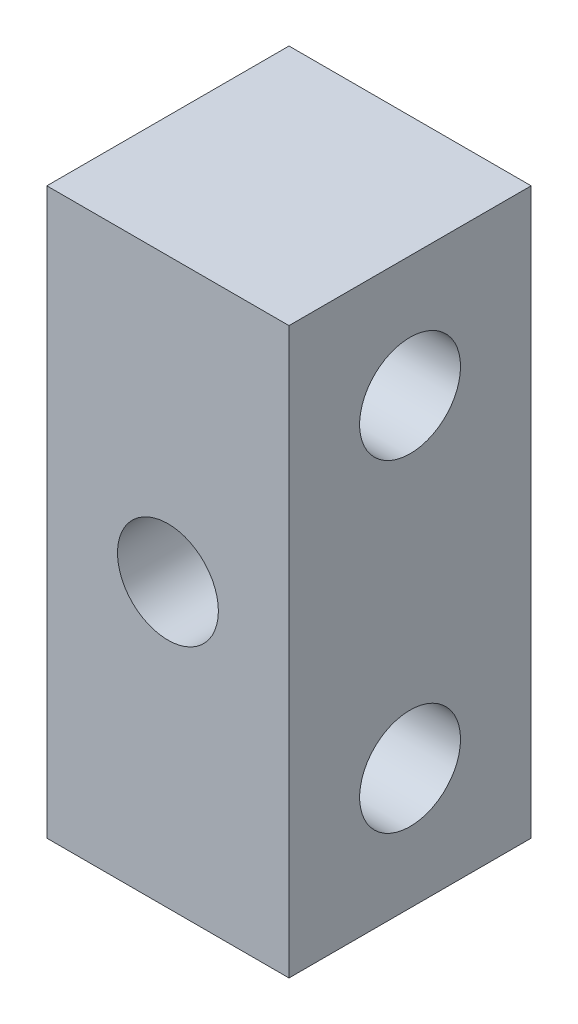
ISO-10303-21;
HEADER;
FILE_DESCRIPTION(('STEP AP214'),'2;1');
FILE_NAME('part.step','',(''),(''),'','','');
FILE_SCHEMA(('AUTOMOTIVE_DESIGN { 1 0 10303 214 1 1 1 1 }'));
ENDSEC;
DATA;
#1=APPLICATION_CONTEXT('core data for automotive mechanical design processes');
#2=APPLICATION_PROTOCOL_DEFINITION('international standard','automotive_design',2000,#1);
#3=PRODUCT_CONTEXT('',#1,'mechanical');
#4=PRODUCT('Part','Part','',(#3));
#5=PRODUCT_RELATED_PRODUCT_CATEGORY('part','',(#4));
#6=PRODUCT_DEFINITION_FORMATION('','',#4);
#7=PRODUCT_DEFINITION_CONTEXT('part definition',#1,'design');
#8=PRODUCT_DEFINITION('design','',#6,#7);
#9=PRODUCT_DEFINITION_SHAPE('','',#8);
#10=(LENGTH_UNIT() NAMED_UNIT(*) SI_UNIT(.MILLI.,.METRE.));
#11=(NAMED_UNIT(*) PLANE_ANGLE_UNIT() SI_UNIT($,.RADIAN.));
#12=(NAMED_UNIT(*) SI_UNIT($,.STERADIAN.) SOLID_ANGLE_UNIT());
#13=UNCERTAINTY_MEASURE_WITH_UNIT(LENGTH_MEASURE(1.E-05),#10,'distance_accuracy_value','');
#14=(GEOMETRIC_REPRESENTATION_CONTEXT(3) GLOBAL_UNCERTAINTY_ASSIGNED_CONTEXT((#13)) GLOBAL_UNIT_ASSIGNED_CONTEXT((#10,
#11,#12)) REPRESENTATION_CONTEXT('',''));
#15=CARTESIAN_POINT('',(0.,0.,0.));
#16=DIRECTION('',(0.,0.,1.));
#17=DIRECTION('',(1.,0.,0.));
#18=AXIS2_PLACEMENT_3D('',#15,#16,#17);
#19=CARTESIAN_POINT('',(6.,0.,0.));
#20=DIRECTION('',(1.,0.,0.));
#21=DIRECTION('',(0.,0.,-1.));
#22=AXIS2_PLACEMENT_3D('',#19,#20,#21);
#23=PLANE('',#22);
#24=CARTESIAN_POINT('',(6.,4.,0.));
#25=DIRECTION('',(1.,0.,0.));
#26=DIRECTION('',(0.,0.,-1.));
#27=AXIS2_PLACEMENT_3D('',#24,#25,#26);
#28=CIRCLE('',#27,1.25);
#29=CARTESIAN_POINT('',(6.,4.,-1.25));
#30=VERTEX_POINT('',#29);
#31=EDGE_CURVE('E103',#30,#30,#28,.T.);
#32=ORIENTED_EDGE('',*,*,#31,.F.);
#33=EDGE_LOOP('',(#32));
#34=FACE_BOUND('',#33,.T.);
#35=DIRECTION('',(0.,1.,0.));
#36=VECTOR('',#35,1.);
#37=CARTESIAN_POINT('',(6.,7.,-3.));
#38=LINE('',#37,#36);
#39=CARTESIAN_POINT('',(6.,-7.,-3.));
#40=VERTEX_POINT('',#39);
#41=CARTESIAN_POINT('',(6.,7.,-3.));
#42=VERTEX_POINT('',#41);
#43=EDGE_CURVE('E88',#40,#42,#38,.T.);
#44=ORIENTED_EDGE('',*,*,#43,.T.);
#45=DIRECTION('',(0.,0.,1.));
#46=VECTOR('',#45,1.);
#47=CARTESIAN_POINT('',(6.,7.,3.));
#48=LINE('',#47,#46);
#49=CARTESIAN_POINT('',(6.,7.,3.));
#50=VERTEX_POINT('',#49);
#51=EDGE_CURVE('E83',#42,#50,#48,.T.);
#52=ORIENTED_EDGE('',*,*,#51,.T.);
#53=DIRECTION('',(0.,-1.,0.));
#54=VECTOR('',#53,1.);
#55=CARTESIAN_POINT('',(6.,7.,3.));
#56=LINE('',#55,#54);
#57=CARTESIAN_POINT('',(6.,-7.,3.));
#58=VERTEX_POINT('',#57);
#59=EDGE_CURVE('E86',#50,#58,#56,.T.);
#60=ORIENTED_EDGE('',*,*,#59,.T.);
#61=DIRECTION('',(0.,0.,-1.));
#62=VECTOR('',#61,1.);
#63=CARTESIAN_POINT('',(6.,-7.,3.));
#64=LINE('',#63,#62);
#65=EDGE_CURVE('E53',#58,#40,#64,.T.);
#66=ORIENTED_EDGE('',*,*,#65,.T.);
#67=EDGE_LOOP('',(#44,#52,#60,#66));
#68=FACE_BOUND('',#67,.T.);
#69=CARTESIAN_POINT('',(6.,-4.,0.));
#70=DIRECTION('',(1.,0.,0.));
#71=DIRECTION('',(0.,0.,-1.));
#72=AXIS2_PLACEMENT_3D('',#69,#70,#71);
#73=CIRCLE('',#72,1.25);
#74=CARTESIAN_POINT('',(6.,-4.,-1.25));
#75=VERTEX_POINT('',#74);
#76=EDGE_CURVE('E118',#75,#75,#73,.T.);
#77=ORIENTED_EDGE('',*,*,#76,.F.);
#78=EDGE_LOOP('',(#77));
#79=FACE_BOUND('',#78,.T.);
#80=ADVANCED_FACE('F36',(#34,#68,#79),#23,.T.);
#81=CARTESIAN_POINT('',(0.,0.,0.));
#82=DIRECTION('',(1.,0.,0.));
#83=DIRECTION('',(0.,0.,-1.));
#84=AXIS2_PLACEMENT_3D('',#81,#82,#83);
#85=PLANE('',#84);
#86=DIRECTION('',(0.,1.,0.));
#87=VECTOR('',#86,1.);
#88=CARTESIAN_POINT('',(0.,7.,-3.));
#89=LINE('',#88,#87);
#90=CARTESIAN_POINT('',(0.,-7.,-3.));
#91=VERTEX_POINT('',#90);
#92=CARTESIAN_POINT('',(0.,7.,-3.));
#93=VERTEX_POINT('',#92);
#94=EDGE_CURVE('E100',#91,#93,#89,.T.);
#95=ORIENTED_EDGE('',*,*,#94,.F.);
#96=DIRECTION('',(0.,0.,-1.));
#97=VECTOR('',#96,1.);
#98=CARTESIAN_POINT('',(0.,-7.,3.));
#99=LINE('',#98,#97);
#100=CARTESIAN_POINT('',(0.,-7.,3.));
#101=VERTEX_POINT('',#100);
#102=EDGE_CURVE('E76',#101,#91,#99,.T.);
#103=ORIENTED_EDGE('',*,*,#102,.F.);
#104=DIRECTION('',(0.,-1.,0.));
#105=VECTOR('',#104,1.);
#106=CARTESIAN_POINT('',(0.,7.,3.));
#107=LINE('',#106,#105);
#108=CARTESIAN_POINT('',(0.,7.,3.));
#109=VERTEX_POINT('',#108);
#110=EDGE_CURVE('E70',#109,#101,#107,.T.);
#111=ORIENTED_EDGE('',*,*,#110,.F.);
#112=DIRECTION('',(0.,0.,1.));
#113=VECTOR('',#112,1.);
#114=CARTESIAN_POINT('',(0.,7.,3.));
#115=LINE('',#114,#113);
#116=EDGE_CURVE('E92',#93,#109,#115,.T.);
#117=ORIENTED_EDGE('',*,*,#116,.F.);
#118=EDGE_LOOP('',(#95,#103,#111,#117));
#119=FACE_BOUND('',#118,.T.);
#120=CARTESIAN_POINT('',(0.,4.,0.));
#121=DIRECTION('',(1.,0.,0.));
#122=DIRECTION('',(0.,0.,-1.));
#123=AXIS2_PLACEMENT_3D('',#120,#121,#122);
#124=CIRCLE('',#123,1.25);
#125=CARTESIAN_POINT('',(0.,4.,-1.25));
#126=VERTEX_POINT('',#125);
#127=EDGE_CURVE('E115',#126,#126,#124,.T.);
#128=ORIENTED_EDGE('',*,*,#127,.T.);
#129=EDGE_LOOP('',(#128));
#130=FACE_BOUND('',#129,.T.);
#131=CARTESIAN_POINT('',(0.,-4.,0.));
#132=DIRECTION('',(1.,0.,0.));
#133=DIRECTION('',(0.,0.,-1.));
#134=AXIS2_PLACEMENT_3D('',#131,#132,#133);
#135=CIRCLE('',#134,1.25);
#136=CARTESIAN_POINT('',(0.,-4.,-1.25));
#137=VERTEX_POINT('',#136);
#138=EDGE_CURVE('E121',#137,#137,#135,.T.);
#139=ORIENTED_EDGE('',*,*,#138,.T.);
#140=EDGE_LOOP('',(#139));
#141=FACE_BOUND('',#140,.T.);
#142=ADVANCED_FACE('F111',(#119,#130,#141),#85,.F.);
#143=CARTESIAN_POINT('',(6.,7.,-3.));
#144=DIRECTION('',(0.,0.,1.));
#145=DIRECTION('',(1.,0.,0.));
#146=AXIS2_PLACEMENT_3D('',#143,#144,#145);
#147=PLANE('',#146);
#148=CARTESIAN_POINT('',(3.,0.,-3.));
#149=DIRECTION('',(0.,0.,1.));
#150=DIRECTION('',(1.,0.,0.));
#151=AXIS2_PLACEMENT_3D('',#148,#149,#150);
#152=CIRCLE('',#151,1.25);
#153=CARTESIAN_POINT('',(4.25,0.,-3.));
#154=VERTEX_POINT('',#153);
#155=EDGE_CURVE('E124',#154,#154,#152,.T.);
#156=ORIENTED_EDGE('',*,*,#155,.T.);
#157=EDGE_LOOP('',(#156));
#158=FACE_BOUND('',#157,.T.);
#159=ORIENTED_EDGE('',*,*,#94,.T.);
#160=DIRECTION('',(-1.,0.,0.));
#161=VECTOR('',#160,1.);
#162=CARTESIAN_POINT('',(6.,7.,-3.));
#163=LINE('',#162,#161);
#164=EDGE_CURVE('E11',#42,#93,#163,.T.);
#165=ORIENTED_EDGE('',*,*,#164,.F.);
#166=ORIENTED_EDGE('',*,*,#43,.F.);
#167=DIRECTION('',(-1.,0.,0.));
#168=VECTOR('',#167,1.);
#169=CARTESIAN_POINT('',(6.,-7.,-3.));
#170=LINE('',#169,#168);
#171=EDGE_CURVE('E96',#40,#91,#170,.T.);
#172=ORIENTED_EDGE('',*,*,#171,.T.);
#173=EDGE_LOOP('',(#159,#165,#166,#172));
#174=FACE_BOUND('',#173,.T.);
#175=ADVANCED_FACE('F38',(#158,#174),#147,.F.);
#176=CARTESIAN_POINT('',(6.,7.,3.));
#177=DIRECTION('',(0.,-1.,0.));
#178=DIRECTION('',(0.,0.,-1.));
#179=AXIS2_PLACEMENT_3D('',#176,#177,#178);
#180=PLANE('',#179);
#181=ORIENTED_EDGE('',*,*,#116,.T.);
#182=DIRECTION('',(-1.,0.,0.));
#183=VECTOR('',#182,1.);
#184=CARTESIAN_POINT('',(6.,7.,3.));
#185=LINE('',#184,#183);
#186=EDGE_CURVE('E45',#50,#109,#185,.T.);
#187=ORIENTED_EDGE('',*,*,#186,.F.);
#188=ORIENTED_EDGE('',*,*,#51,.F.);
#189=ORIENTED_EDGE('',*,*,#164,.T.);
#190=EDGE_LOOP('',(#181,#187,#188,#189));
#191=FACE_BOUND('',#190,.T.);
#192=ADVANCED_FACE('F91',(#191),#180,.F.);
#193=CARTESIAN_POINT('',(6.,7.,3.));
#194=DIRECTION('',(0.,0.,-1.));
#195=DIRECTION('',(-1.,0.,0.));
#196=AXIS2_PLACEMENT_3D('',#193,#194,#195);
#197=PLANE('',#196);
#198=CARTESIAN_POINT('',(3.,0.,3.));
#199=DIRECTION('',(0.,0.,1.));
#200=DIRECTION('',(1.,0.,0.));
#201=AXIS2_PLACEMENT_3D('',#198,#199,#200);
#202=CIRCLE('',#201,1.25);
#203=CARTESIAN_POINT('',(4.25,0.,3.));
#204=VERTEX_POINT('',#203);
#205=EDGE_CURVE('E127',#204,#204,#202,.T.);
#206=ORIENTED_EDGE('',*,*,#205,.F.);
#207=EDGE_LOOP('',(#206));
#208=FACE_BOUND('',#207,.T.);
#209=ORIENTED_EDGE('',*,*,#110,.T.);
#210=DIRECTION('',(-1.,0.,0.));
#211=VECTOR('',#210,1.);
#212=CARTESIAN_POINT('',(6.,-7.,3.));
#213=LINE('',#212,#211);
#214=EDGE_CURVE('E93',#58,#101,#213,.T.);
#215=ORIENTED_EDGE('',*,*,#214,.F.);
#216=ORIENTED_EDGE('',*,*,#59,.F.);
#217=ORIENTED_EDGE('',*,*,#186,.T.);
#218=EDGE_LOOP('',(#209,#215,#216,#217));
#219=FACE_BOUND('',#218,.T.);
#220=ADVANCED_FACE('F94',(#208,#219),#197,.F.);
#221=CARTESIAN_POINT('',(6.,-7.,3.));
#222=DIRECTION('',(0.,1.,0.));
#223=DIRECTION('',(0.,0.,1.));
#224=AXIS2_PLACEMENT_3D('',#221,#222,#223);
#225=PLANE('',#224);
#226=ORIENTED_EDGE('',*,*,#102,.T.);
#227=ORIENTED_EDGE('',*,*,#171,.F.);
#228=ORIENTED_EDGE('',*,*,#65,.F.);
#229=ORIENTED_EDGE('',*,*,#214,.T.);
#230=EDGE_LOOP('',(#226,#227,#228,#229));
#231=FACE_BOUND('',#230,.T.);
#232=ADVANCED_FACE('F108',(#231),#225,.F.);
#233=CARTESIAN_POINT('',(6.,4.,0.));
#234=DIRECTION('',(-1.,0.,0.));
#235=DIRECTION('',(0.,0.,1.));
#236=AXIS2_PLACEMENT_3D('',#233,#234,#235);
#237=CYLINDRICAL_SURFACE('',#236,1.25);
#238=ORIENTED_EDGE('',*,*,#31,.T.);
#239=EDGE_LOOP('',(#238));
#240=FACE_BOUND('',#239,.T.);
#241=ORIENTED_EDGE('',*,*,#127,.F.);
#242=EDGE_LOOP('',(#241));
#243=FACE_BOUND('',#242,.T.);
#244=ADVANCED_FACE('F147',(#240,#243),#237,.F.);
#245=CARTESIAN_POINT('',(6.,-4.,0.));
#246=DIRECTION('',(-1.,0.,0.));
#247=DIRECTION('',(0.,0.,1.));
#248=AXIS2_PLACEMENT_3D('',#245,#246,#247);
#249=CYLINDRICAL_SURFACE('',#248,1.25);
#250=ORIENTED_EDGE('',*,*,#76,.T.);
#251=EDGE_LOOP('',(#250));
#252=FACE_BOUND('',#251,.T.);
#253=ORIENTED_EDGE('',*,*,#138,.F.);
#254=EDGE_LOOP('',(#253));
#255=FACE_BOUND('',#254,.T.);
#256=ADVANCED_FACE('F137',(#252,#255),#249,.F.);
#257=CARTESIAN_POINT('',(3.,0.,-3.));
#258=DIRECTION('',(0.,0.,1.));
#259=DIRECTION('',(1.,0.,0.));
#260=AXIS2_PLACEMENT_3D('',#257,#258,#259);
#261=CYLINDRICAL_SURFACE('',#260,1.25);
#262=ORIENTED_EDGE('',*,*,#155,.F.);
#263=EDGE_LOOP('',(#262));
#264=FACE_BOUND('',#263,.T.);
#265=ORIENTED_EDGE('',*,*,#205,.T.);
#266=EDGE_LOOP('',(#265));
#267=FACE_BOUND('',#266,.T.);
#268=ADVANCED_FACE('F134',(#264,#267),#261,.F.);
#269=CLOSED_SHELL('',(#80,#142,#175,#192,#220,#232,#244,#256,#268));
#270=MANIFOLD_SOLID_BREP('B2',#269);
#271=ADVANCED_BREP_SHAPE_REPRESENTATION('',(#18,#270),#14);
#272=SHAPE_DEFINITION_REPRESENTATION(#9,#271);
ENDSEC;
END-ISO-10303-21;
